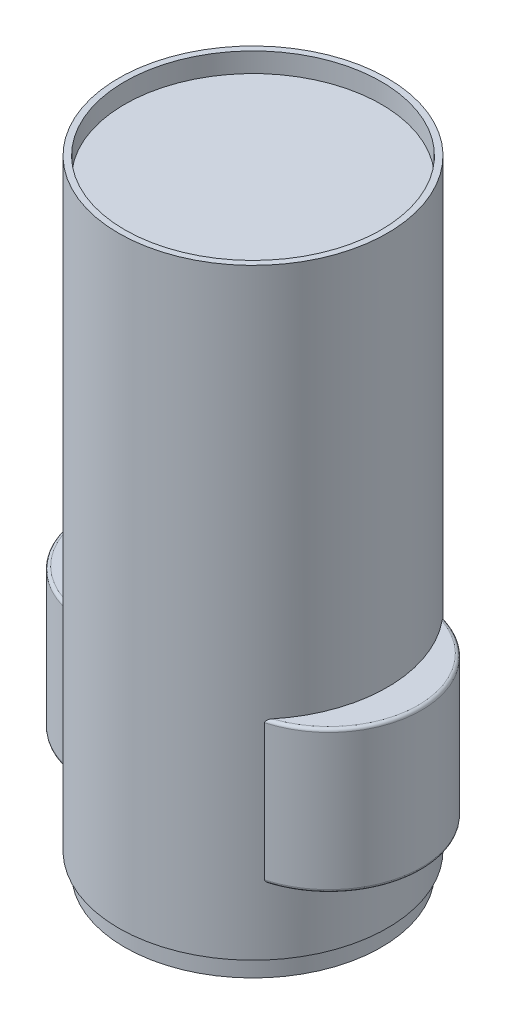
ISO-10303-21;
HEADER;
FILE_DESCRIPTION(('STEP AP214'),'2;1');
FILE_NAME('part.step','',(''),(''),'','','');
FILE_SCHEMA(('AUTOMOTIVE_DESIGN { 1 0 10303 214 1 1 1 1 }'));
ENDSEC;
DATA;
#1=APPLICATION_CONTEXT('core data for automotive mechanical design processes');
#2=APPLICATION_PROTOCOL_DEFINITION('international standard','automotive_design',2000,#1);
#3=PRODUCT_CONTEXT('',#1,'mechanical');
#4=PRODUCT('Part','Part','',(#3));
#5=PRODUCT_RELATED_PRODUCT_CATEGORY('part','',(#4));
#6=PRODUCT_DEFINITION_FORMATION('','',#4);
#7=PRODUCT_DEFINITION_CONTEXT('part definition',#1,'design');
#8=PRODUCT_DEFINITION('design','',#6,#7);
#9=PRODUCT_DEFINITION_SHAPE('','',#8);
#10=(LENGTH_UNIT() NAMED_UNIT(*) SI_UNIT(.MILLI.,.METRE.));
#11=(NAMED_UNIT(*) PLANE_ANGLE_UNIT() SI_UNIT($,.RADIAN.));
#12=(NAMED_UNIT(*) SI_UNIT($,.STERADIAN.) SOLID_ANGLE_UNIT());
#13=UNCERTAINTY_MEASURE_WITH_UNIT(LENGTH_MEASURE(1.E-05),#10,'distance_accuracy_value','');
#14=(GEOMETRIC_REPRESENTATION_CONTEXT(3) GLOBAL_UNCERTAINTY_ASSIGNED_CONTEXT((#13)) GLOBAL_UNIT_ASSIGNED_CONTEXT((#10,
#11,#12)) REPRESENTATION_CONTEXT('',''));
#15=CARTESIAN_POINT('',(0.,0.,0.));
#16=DIRECTION('',(0.,0.,1.));
#17=DIRECTION('',(1.,0.,0.));
#18=AXIS2_PLACEMENT_3D('',#15,#16,#17);
#19=CARTESIAN_POINT('',(0.,199.3,0.));
#20=DIRECTION('',(0.,1.,0.));
#21=DIRECTION('',(0.,0.,1.));
#22=AXIS2_PLACEMENT_3D('',#19,#20,#21);
#23=CYLINDRICAL_SURFACE('',#22,44.5);
#24=CARTESIAN_POINT('',(0.,205.8,0.));
#25=DIRECTION('',(0.,1.,0.));
#26=DIRECTION('',(0.,0.,1.));
#27=AXIS2_PLACEMENT_3D('',#24,#25,#26);
#28=CIRCLE('',#27,44.5);
#29=CARTESIAN_POINT('',(0.,205.8,44.5));
#30=VERTEX_POINT('',#29);
#31=EDGE_CURVE('E188',#30,#30,#28,.T.);
#32=ORIENTED_EDGE('',*,*,#31,.F.);
#33=EDGE_LOOP('',(#32));
#34=FACE_BOUND('',#33,.T.);
#35=CARTESIAN_POINT('',(0.,6.49999999999998,0.));
#36=DIRECTION('',(0.,1.,0.));
#37=DIRECTION('',(0.,0.,1.));
#38=AXIS2_PLACEMENT_3D('',#35,#36,#37);
#39=CIRCLE('',#38,44.5);
#40=CARTESIAN_POINT('',(0.,6.49999999999997,44.5));
#41=VERTEX_POINT('',#40);
#42=EDGE_CURVE('E191',#41,#41,#39,.T.);
#43=ORIENTED_EDGE('',*,*,#42,.T.);
#44=EDGE_LOOP('',(#43));
#45=FACE_BOUND('',#44,.T.);
#46=DIRECTION('',(0.,-1.,0.));
#47=VECTOR('',#46,1.);
#48=CARTESIAN_POINT('',(33.3282803180915,52.035,29.4868738770104));
#49=LINE('',#48,#47);
#50=CARTESIAN_POINT('',(33.3282803180915,74.57,29.4868738770104));
#51=VERTEX_POINT('',#50);
#52=CARTESIAN_POINT('',(33.3282803180915,29.5,29.4868738770104));
#53=VERTEX_POINT('',#52);
#54=EDGE_CURVE('E206',#51,#53,#49,.T.);
#55=ORIENTED_EDGE('',*,*,#54,.F.);
#56=CARTESIAN_POINT('',(33.3282803180915,74.57,29.4868738770104));
#57=CARTESIAN_POINT('',(33.3282290648274,74.6026941237317,29.4869303399323));
#58=CARTESIAN_POINT('',(33.3302284768937,74.6352940124547,29.4846719704872));
#59=CARTESIAN_POINT('',(33.3378637860314,74.6991919996134,29.4760393006147));
#60=CARTESIAN_POINT('',(33.3434638686415,74.7304997219744,29.4697055360972));
#61=CARTESIAN_POINT('',(33.3594192153649,74.7980036695551,29.4516436502028));
#62=CARTESIAN_POINT('',(33.370544747942,74.8337785634002,29.4390408183785));
#63=CARTESIAN_POINT('',(33.396485341139,74.9022007333026,29.409609914728));
#64=CARTESIAN_POINT('',(33.4113149859387,74.9348349226258,29.392765138918));
#65=CARTESIAN_POINT('',(33.4516346665935,75.0119389908455,29.346881596507));
#66=CARTESIAN_POINT('',(33.4787878172227,75.0543735176097,29.3159120704458));
#67=CARTESIAN_POINT('',(33.5368766703659,75.1324837514766,29.2494421360369));
#68=CARTESIAN_POINT('',(33.5678191018013,75.1681471396393,29.2139336624827));
#69=CARTESIAN_POINT('',(33.6276500485631,75.2290649353552,29.1450328354835));
#70=CARTESIAN_POINT('',(33.6562287820361,75.2550769395084,29.1120293654524));
#71=CARTESIAN_POINT('',(33.7146426992063,75.3032701830073,29.0443604457293));
#72=CARTESIAN_POINT('',(33.7444787823177,75.3254486202009,29.0096938037871));
#73=CARTESIAN_POINT('',(33.8355193205995,75.3870399433358,28.9035689894966));
#74=CARTESIAN_POINT('',(33.8980431408311,75.4213051613941,28.8302307541396));
#75=CARTESIAN_POINT('',(34.0079639573205,75.4709328743049,28.7004118095175));
#76=CARTESIAN_POINT('',(34.0550148833266,75.4888966803664,28.6445699545817));
#77=CARTESIAN_POINT('',(34.1496142551314,75.5192581407077,28.5317237699701));
#78=CARTESIAN_POINT('',(34.1971630299818,75.531651840051,28.4747186442662));
#79=CARTESIAN_POINT('',(34.2915505944723,75.5510828137592,28.360975315293));
#80=CARTESIAN_POINT('',(34.3383870002181,75.5582112864938,28.3042503438402));
#81=CARTESIAN_POINT('',(34.431898756543,75.5676543482635,28.1904201735461));
#82=CARTESIAN_POINT('',(34.478574245033,75.5699766769948,28.1333157348268));
#83=CARTESIAN_POINT('',(34.5250994035786,75.57,28.0761021363903));
#84=B_SPLINE_CURVE_WITH_KNOTS('',3,(#56,#57,#58,#59,#60,#61,#62,#63,#64,#65,#66,#67,#68,#69,#70,
#71,#72,#73,#74,#75,#76,#77,#78,#79,#80,#81,#82,#83),.UNSPECIFIED.,.F.,.F.,(4,2,2,2,2,2,2,2,2,2,
2,2,2,4),(0.,0.0977907833194195,0.194623619100568,0.312556690935294,0.430961628564803,
0.607381289542884,0.784118903501161,0.936359281983716,1.08871047450898,1.39455002030677,
1.61995867637769,1.84552712723387,2.06709051691682,2.28829682783787),.UNSPECIFIED.);
#85=CARTESIAN_POINT('',(34.5250994035785,75.57,28.0761021363903));
#86=VERTEX_POINT('',#85);
#87=EDGE_CURVE('E269',#51,#86,#84,.T.);
#88=ORIENTED_EDGE('',*,*,#87,.T.);
#89=CARTESIAN_POINT('',(0.,75.57,0.));
#90=DIRECTION('',(0.,-1.,0.));
#91=DIRECTION('',(0.,0.,-1.));
#92=AXIS2_PLACEMENT_3D('',#89,#90,#91);
#93=CIRCLE('',#92,44.5);
#94=CARTESIAN_POINT('',(34.5250994035785,75.57,-28.0761021363903));
#95=VERTEX_POINT('',#94);
#96=EDGE_CURVE('E205',#86,#95,#93,.F.);
#97=ORIENTED_EDGE('',*,*,#96,.T.);
#98=CARTESIAN_POINT('',(34.5250994035785,75.57,-28.0761021363903));
#99=CARTESIAN_POINT('',(34.471886137988,75.5699594992287,-28.1415416811893));
#100=CARTESIAN_POINT('',(34.4184661535623,75.566930112156,-28.2068487604138));
#101=CARTESIAN_POINT('',(34.3113889509015,75.5545478072244,-28.3370016309063));
#102=CARTESIAN_POINT('',(34.2577315120177,75.5451752217279,-28.4018453516787));
#103=CARTESIAN_POINT('',(34.1504178926029,75.519691929258,-28.5307911176014));
#104=CARTESIAN_POINT('',(34.0967631197051,75.5035470340788,-28.594887679342));
#105=CARTESIAN_POINT('',(33.9902994158401,75.4638607460808,-28.7213570976742));
#106=CARTESIAN_POINT('',(33.9374893288381,75.4403305713274,-28.7837324134913));
#107=CARTESIAN_POINT('',(33.8466803975093,75.3918891807662,-28.8904103855184));
#108=CARTESIAN_POINT('',(33.8083356271671,75.3688568274594,-28.9352690547207));
#109=CARTESIAN_POINT('',(33.7329920912511,75.3174471095592,-29.0230698624084));
#110=CARTESIAN_POINT('',(33.6959933682544,75.2890695760661,-29.0660119402794));
#111=CARTESIAN_POINT('',(33.6238337207307,75.2258820795504,-29.1494574891499));
#112=CARTESIAN_POINT('',(33.5886899967836,75.1910221530623,-29.1899385354299));
#113=CARTESIAN_POINT('',(33.5219136178637,75.1139527204496,-29.266599871983));
#114=CARTESIAN_POINT('',(33.4902726723159,75.0717612035702,-29.3027903325259));
#115=CARTESIAN_POINT('',(33.4442255225117,74.9974912433359,-29.3553143046088));
#116=CARTESIAN_POINT('',(33.427979634385,74.9680937562659,-29.3738095103277));
#117=CARTESIAN_POINT('',(33.3982889739881,74.9061176044222,-29.4075635929464));
#118=CARTESIAN_POINT('',(33.384844802923,74.8735382590694,-29.4228217752439));
#119=CARTESIAN_POINT('',(33.3615321712417,74.8049792472937,-29.4492527673272));
#120=CARTESIAN_POINT('',(33.3517118060886,74.7689613136333,-29.4603706432227));
#121=CARTESIAN_POINT('',(33.3369283456302,74.6947536654882,-29.4770985480268));
#122=CARTESIAN_POINT('',(33.3319471321069,74.6565726228997,-29.4827291221386));
#123=CARTESIAN_POINT('',(33.3292193392278,74.6101066554781,-29.4858124833861));
#124=CARTESIAN_POINT('',(33.3288674390376,74.6020923627154,-29.4862102513128));
#125=CARTESIAN_POINT('',(33.3283983710121,74.586053172617,-29.4867404526471));
#126=CARTESIAN_POINT('',(33.3282810559128,74.5780282851008,-29.4868730525174));
#127=CARTESIAN_POINT('',(33.3282803180915,74.57,-29.4868738770104));
#128=B_SPLINE_CURVE_WITH_KNOTS('',3,(#98,#99,#100,#101,#102,#103,#104,#105,#106,#107,#108,#109,
#110,#111,#112,#113,#114,#115,#116,#117,#118,#119,#120,#121,#122,#123,#124,#125,#126,#127),
.UNSPECIFIED.,.F.,.F.,(4,2,2,2,2,2,2,2,2,2,2,2,2,2,4),(0.,0.253023706346703,0.50683555079611,
0.761944417442202,1.0166676399544,1.20650028717804,1.39633893383444,1.5877064596561,
1.77861089874805,1.89335142921242,2.00811655592235,2.12435429681833,2.24015513641538,
2.26424639201346,2.28832251924724),.UNSPECIFIED.);
#129=CARTESIAN_POINT('',(33.3282803180915,74.57,-29.4868738770104));
#130=VERTEX_POINT('',#129);
#131=EDGE_CURVE('E276',#95,#130,#128,.T.);
#132=ORIENTED_EDGE('',*,*,#131,.T.);
#133=DIRECTION('',(0.,-1.,0.));
#134=VECTOR('',#133,1.);
#135=CARTESIAN_POINT('',(33.3282803180915,52.035,-29.4868738770104));
#136=LINE('',#135,#134);
#137=CARTESIAN_POINT('',(33.3282803180915,29.5,-29.4868738770104));
#138=VERTEX_POINT('',#137);
#139=EDGE_CURVE('E209',#138,#130,#136,.F.);
#140=ORIENTED_EDGE('',*,*,#139,.F.);
#141=CARTESIAN_POINT('',(33.3282803180915,29.5,-29.4868738770104));
#142=CARTESIAN_POINT('',(33.3282290648274,29.4673058762683,-29.4869303399324));
#143=CARTESIAN_POINT('',(33.3302284768936,29.4347059875453,-29.4846719704872));
#144=CARTESIAN_POINT('',(33.3378637860314,29.3708080003866,-29.4760393006147));
#145=CARTESIAN_POINT('',(33.3434638686415,29.3395002780256,-29.4697055360972));
#146=CARTESIAN_POINT('',(33.3594192153649,29.2719963304449,-29.4516436502028));
#147=CARTESIAN_POINT('',(33.370544747942,29.2362214365998,-29.4390408183785));
#148=CARTESIAN_POINT('',(33.396485341139,29.1677992666973,-29.409609914728));
#149=CARTESIAN_POINT('',(33.4113149859387,29.1351650773742,-29.3927651389181));
#150=CARTESIAN_POINT('',(33.4516346665935,29.0580610091545,-29.3468815965071));
#151=CARTESIAN_POINT('',(33.4787878172227,29.0156264823903,-29.3159120704458));
#152=CARTESIAN_POINT('',(33.5368766703659,28.9375162485234,-29.2494421360369));
#153=CARTESIAN_POINT('',(33.5678191018013,28.9018528603607,-29.2139336624827));
#154=CARTESIAN_POINT('',(33.6276500485631,28.8409350646448,-29.1450328354835));
#155=CARTESIAN_POINT('',(33.6562287820361,28.8149230604916,-29.1120293654524));
#156=CARTESIAN_POINT('',(33.7146426992063,28.7667298169927,-29.0443604457293));
#157=CARTESIAN_POINT('',(33.7444787823177,28.7445513797991,-29.0096938037871));
#158=CARTESIAN_POINT('',(33.8355193205995,28.6829600566642,-28.9035689894966));
#159=CARTESIAN_POINT('',(33.898043140831,28.6486948386059,-28.8302307541397));
#160=CARTESIAN_POINT('',(34.0079639573205,28.5990671256951,-28.7004118095175));
#161=CARTESIAN_POINT('',(34.0550148833266,28.5811033196336,-28.6445699545817));
#162=CARTESIAN_POINT('',(34.1496142551314,28.5507418592922,-28.5317237699702));
#163=CARTESIAN_POINT('',(34.1971630299818,28.538348159949,-28.4747186442662));
#164=CARTESIAN_POINT('',(34.2915505944723,28.5189171862408,-28.360975315293));
#165=CARTESIAN_POINT('',(34.338387000218,28.5117887135062,-28.3042503438402));
#166=CARTESIAN_POINT('',(34.431898756543,28.5023456517365,-28.1904201735462));
#167=CARTESIAN_POINT('',(34.478574245033,28.5000233230052,-28.1333157348268));
#168=CARTESIAN_POINT('',(34.5250994035785,28.5,-28.0761021363903));
#169=B_SPLINE_CURVE_WITH_KNOTS('',3,(#141,#142,#143,#144,#145,#146,#147,#148,#149,#150,#151,
#152,#153,#154,#155,#156,#157,#158,#159,#160,#161,#162,#163,#164,#165,#166,#167,#168),
.UNSPECIFIED.,.F.,.F.,(4,2,2,2,2,2,2,2,2,2,2,2,2,4),(0.,0.0977907833194221,0.194623619100572,
0.312556690935311,0.430961628564806,0.607381289542887,0.784118903501163,0.936359281983706,
1.08871047450897,1.39455002030677,1.61995867637769,1.84552712723387,2.06709051691681,
2.28829682783787),.UNSPECIFIED.);
#170=CARTESIAN_POINT('',(34.5250994035785,28.5,-28.0761021363903));
#171=VERTEX_POINT('',#170);
#172=EDGE_CURVE('E246',#138,#171,#169,.T.);
#173=ORIENTED_EDGE('',*,*,#172,.T.);
#174=CARTESIAN_POINT('',(0.,28.5,0.));
#175=DIRECTION('',(0.,-1.,0.));
#176=DIRECTION('',(0.,0.,-1.));
#177=AXIS2_PLACEMENT_3D('',#174,#175,#176);
#178=CIRCLE('',#177,44.5);
#179=CARTESIAN_POINT('',(34.5250994035786,28.5,28.0761021363903));
#180=VERTEX_POINT('',#179);
#181=EDGE_CURVE('E200',#180,#171,#178,.F.);
#182=ORIENTED_EDGE('',*,*,#181,.F.);
#183=CARTESIAN_POINT('',(34.5250994035785,28.5,28.0761021363903));
#184=CARTESIAN_POINT('',(34.4718861379881,28.5000405007713,28.1415416811893));
#185=CARTESIAN_POINT('',(34.4184661535623,28.503069887844,28.2068487604138));
#186=CARTESIAN_POINT('',(34.3113889509015,28.5154521927756,28.3370016309063));
#187=CARTESIAN_POINT('',(34.2577315120177,28.5248247782721,28.4018453516786));
#188=CARTESIAN_POINT('',(34.1504178926029,28.550308070742,28.5307911176014));
#189=CARTESIAN_POINT('',(34.0967631197051,28.5664529659212,28.594887679342));
#190=CARTESIAN_POINT('',(33.9902994158401,28.6061392539192,28.7213570976741));
#191=CARTESIAN_POINT('',(33.9374893288382,28.6296694286726,28.7837324134913));
#192=CARTESIAN_POINT('',(33.8466803975093,28.6781108192338,28.8904103855184));
#193=CARTESIAN_POINT('',(33.8083356271672,28.7011431725406,28.9352690547207));
#194=CARTESIAN_POINT('',(33.7329920912511,28.7525528904408,29.0230698624084));
#195=CARTESIAN_POINT('',(33.6959933682544,28.7809304239339,29.0660119402794));
#196=CARTESIAN_POINT('',(33.6238337207308,28.8441179204496,29.1494574891499));
#197=CARTESIAN_POINT('',(33.5886899967836,28.8789778469376,29.1899385354299));
#198=CARTESIAN_POINT('',(33.5219136178638,28.9560472795504,29.266599871983));
#199=CARTESIAN_POINT('',(33.4902726723159,28.9982387964297,29.3027903325258));
#200=CARTESIAN_POINT('',(33.4442255225117,29.0725087566641,29.3553143046088));
#201=CARTESIAN_POINT('',(33.427979634385,29.1019062437341,29.3738095103276));
#202=CARTESIAN_POINT('',(33.3982889739881,29.1638823955777,29.4075635929464));
#203=CARTESIAN_POINT('',(33.384844802923,29.1964617409306,29.4228217752438));
#204=CARTESIAN_POINT('',(33.3615321712417,29.2650207527063,29.4492527673272));
#205=CARTESIAN_POINT('',(33.3517118060886,29.3010386863667,29.4603706432227));
#206=CARTESIAN_POINT('',(33.3369283456302,29.3752463345118,29.4770985480268));
#207=CARTESIAN_POINT('',(33.3319471321069,29.4134273771003,29.4827291221386));
#208=CARTESIAN_POINT('',(33.3292193392278,29.4598933445218,29.4858124833861));
#209=CARTESIAN_POINT('',(33.3288674390376,29.4679076372845,29.4862102513128));
#210=CARTESIAN_POINT('',(33.3283983710121,29.483946827383,29.4867404526471));
#211=CARTESIAN_POINT('',(33.3282810559129,29.4919717148992,29.4868730525174));
#212=CARTESIAN_POINT('',(33.3282803180915,29.5,29.4868738770104));
#213=B_SPLINE_CURVE_WITH_KNOTS('',3,(#183,#184,#185,#186,#187,#188,#189,#190,#191,#192,#193,
#194,#195,#196,#197,#198,#199,#200,#201,#202,#203,#204,#205,#206,#207,#208,#209,#210,#211,#212),
.UNSPECIFIED.,.F.,.F.,(4,2,2,2,2,2,2,2,2,2,2,2,2,2,4),(0.,0.253023706346701,0.50683555079612,
0.761944417442207,1.0166676399544,1.20650028717802,1.39633893383443,1.58770645965609,
1.77861089874804,1.8933514292124,2.00811655592233,2.1243542968183,2.24015513641535,
2.26424639201344,2.28832251924726),.UNSPECIFIED.);
#214=EDGE_CURVE('E239',#180,#53,#213,.T.);
#215=ORIENTED_EDGE('',*,*,#214,.T.);
#216=EDGE_LOOP('',(#55,#88,#97,#132,#140,#173,#182,#215));
#217=FACE_BOUND('',#216,.T.);
#218=CARTESIAN_POINT('',(0.,175.57,0.));
#219=DIRECTION('',(0.,-1.,0.));
#220=DIRECTION('',(0.,0.,1.));
#221=AXIS2_PLACEMENT_3D('',#218,#219,#220);
#222=CIRCLE('',#221,44.5);
#223=CARTESIAN_POINT('',(-44.2097122743787,175.57,5.07457787571034));
#224=VERTEX_POINT('',#223);
#225=CARTESIAN_POINT('',(-44.2097122743787,175.57,-5.07457787571028));
#226=VERTEX_POINT('',#225);
#227=EDGE_CURVE('E415',#224,#226,#222,.T.);
#228=ORIENTED_EDGE('',*,*,#227,.F.);
#229=DIRECTION('',(0.,-1.,0.));
#230=VECTOR('',#229,1.);
#231=CARTESIAN_POINT('',(-44.2097122743787,175.57,5.07457787571032));
#232=LINE('',#231,#230);
#233=CARTESIAN_POINT('',(-44.2097122743787,75.57,5.0745778757103));
#234=VERTEX_POINT('',#233);
#235=EDGE_CURVE('E178',#224,#234,#232,.T.);
#236=ORIENTED_EDGE('',*,*,#235,.T.);
#237=CARTESIAN_POINT('',(-34.5250994035785,75.57,28.0761021363903));
#238=VERTEX_POINT('',#237);
#239=EDGE_CURVE('E215',#234,#238,#93,.F.);
#240=ORIENTED_EDGE('',*,*,#239,.T.);
#241=CARTESIAN_POINT('',(-34.5250994035785,75.57,28.0761021363903));
#242=CARTESIAN_POINT('',(-34.4718861379881,75.5699594992286,28.1415416811893));
#243=CARTESIAN_POINT('',(-34.4184661535623,75.566930112156,28.2068487604138));
#244=CARTESIAN_POINT('',(-34.3113889509015,75.5545478072243,28.3370016309063));
#245=CARTESIAN_POINT('',(-34.2577315120177,75.5451752217279,28.4018453516786));
#246=CARTESIAN_POINT('',(-34.1504178926029,75.519691929258,28.5307911176014));
#247=CARTESIAN_POINT('',(-34.0967631197051,75.5035470340788,28.594887679342));
#248=CARTESIAN_POINT('',(-33.9902994158401,75.4638607460808,28.7213570976742));
#249=CARTESIAN_POINT('',(-33.9374893288381,75.4403305713274,28.7837324134913));
#250=CARTESIAN_POINT('',(-33.8466803975093,75.3918891807662,28.8904103855184));
#251=CARTESIAN_POINT('',(-33.8083356271672,75.3688568274594,28.9352690547207));
#252=CARTESIAN_POINT('',(-33.7329920912511,75.3174471095592,29.0230698624084));
#253=CARTESIAN_POINT('',(-33.6959933682544,75.2890695760661,29.0660119402794));
#254=CARTESIAN_POINT('',(-33.6238337207308,75.2258820795504,29.1494574891499));
#255=CARTESIAN_POINT('',(-33.5886899967836,75.1910221530623,29.1899385354299));
#256=CARTESIAN_POINT('',(-33.5219136178638,75.1139527204496,29.266599871983));
#257=CARTESIAN_POINT('',(-33.4902726723159,75.0717612035703,29.3027903325258));
#258=CARTESIAN_POINT('',(-33.4442255225117,74.9974912433359,29.3553143046088));
#259=CARTESIAN_POINT('',(-33.427979634385,74.9680937562659,29.3738095103276));
#260=CARTESIAN_POINT('',(-33.3982889739881,74.9061176044223,29.4075635929464));
#261=CARTESIAN_POINT('',(-33.384844802923,74.8735382590694,29.4228217752438));
#262=CARTESIAN_POINT('',(-33.3615321712417,74.8049792472937,29.4492527673272));
#263=CARTESIAN_POINT('',(-33.3517118060886,74.7689613136333,29.4603706432227));
#264=CARTESIAN_POINT('',(-33.3369283456302,74.6947536654882,29.4770985480268));
#265=CARTESIAN_POINT('',(-33.3319471321069,74.6565726228997,29.4827291221386));
#266=CARTESIAN_POINT('',(-33.3292193392278,74.6101066554781,29.4858124833861));
#267=CARTESIAN_POINT('',(-33.3288674390376,74.6020923627155,29.4862102513128));
#268=CARTESIAN_POINT('',(-33.3283983710121,74.586053172617,29.4867404526471));
#269=CARTESIAN_POINT('',(-33.3282810559129,74.5780282851008,29.4868730525174));
#270=CARTESIAN_POINT('',(-33.3282803180915,74.57,29.4868738770104));
#271=B_SPLINE_CURVE_WITH_KNOTS('',3,(#241,#242,#243,#244,#245,#246,#247,#248,#249,#250,#251,
#252,#253,#254,#255,#256,#257,#258,#259,#260,#261,#262,#263,#264,#265,#266,#267,#268,#269,#270),
.UNSPECIFIED.,.F.,.F.,(4,2,2,2,2,2,2,2,2,2,2,2,2,2,4),(0.,0.253023706346694,0.506835550796111,
0.761944417442205,1.0166676399544,1.20650028717803,1.39633893383442,1.58770645965607,
1.77861089874802,1.89335142921238,2.0081165559223,2.1243542968183,2.24015513641536,
2.26424639201345,2.28832251924727),.UNSPECIFIED.);
#272=CARTESIAN_POINT('',(-33.3282803180915,74.57,29.4868738770104));
#273=VERTEX_POINT('',#272);
#274=EDGE_CURVE('E11',#238,#273,#271,.T.);
#275=ORIENTED_EDGE('',*,*,#274,.T.);
#276=DIRECTION('',(0.,-1.,0.));
#277=VECTOR('',#276,1.);
#278=CARTESIAN_POINT('',(-33.3282803180915,52.035,29.4868738770104));
#279=LINE('',#278,#277);
#280=CARTESIAN_POINT('',(-33.3282803180915,29.5,29.4868738770104));
#281=VERTEX_POINT('',#280);
#282=EDGE_CURVE('E218',#281,#273,#279,.F.);
#283=ORIENTED_EDGE('',*,*,#282,.F.);
#284=CARTESIAN_POINT('',(-33.3282803180915,29.5,29.4868738770104));
#285=CARTESIAN_POINT('',(-33.3282290648274,29.4673058762683,29.4869303399323));
#286=CARTESIAN_POINT('',(-33.3302284768937,29.4347059875453,29.4846719704872));
#287=CARTESIAN_POINT('',(-33.3378637860314,29.3708080003866,29.4760393006147));
#288=CARTESIAN_POINT('',(-33.3434638686415,29.3395002780256,29.4697055360972));
#289=CARTESIAN_POINT('',(-33.3594192153649,29.2719963304449,29.4516436502028));
#290=CARTESIAN_POINT('',(-33.370544747942,29.2362214365998,29.4390408183785));
#291=CARTESIAN_POINT('',(-33.396485341139,29.1677992666973,29.409609914728));
#292=CARTESIAN_POINT('',(-33.4113149859387,29.1351650773742,29.392765138918));
#293=CARTESIAN_POINT('',(-33.4516346665935,29.0580610091545,29.346881596507));
#294=CARTESIAN_POINT('',(-33.4787878172227,29.0156264823903,29.3159120704458));
#295=CARTESIAN_POINT('',(-33.5368766703659,28.9375162485234,29.2494421360369));
#296=CARTESIAN_POINT('',(-33.5678191018013,28.9018528603607,29.2139336624827));
#297=CARTESIAN_POINT('',(-33.6276500485631,28.8409350646448,29.1450328354835));
#298=CARTESIAN_POINT('',(-33.6562287820361,28.8149230604916,29.1120293654524));
#299=CARTESIAN_POINT('',(-33.7146426992063,28.7667298169927,29.0443604457293));
#300=CARTESIAN_POINT('',(-33.7444787823177,28.7445513797991,29.0096938037871));
#301=CARTESIAN_POINT('',(-33.8355193205995,28.6829600566642,28.9035689894966));
#302=CARTESIAN_POINT('',(-33.898043140831,28.6486948386059,28.8302307541397));
#303=CARTESIAN_POINT('',(-34.0079639573205,28.5990671256951,28.7004118095175));
#304=CARTESIAN_POINT('',(-34.0550148833266,28.5811033196336,28.6445699545817));
#305=CARTESIAN_POINT('',(-34.1496142551314,28.5507418592922,28.5317237699701));
#306=CARTESIAN_POINT('',(-34.1971630299818,28.538348159949,28.4747186442662));
#307=CARTESIAN_POINT('',(-34.2915505944723,28.5189171862408,28.360975315293));
#308=CARTESIAN_POINT('',(-34.3383870002181,28.5117887135062,28.3042503438402));
#309=CARTESIAN_POINT('',(-34.431898756543,28.5023456517365,28.1904201735461));
#310=CARTESIAN_POINT('',(-34.478574245033,28.5000233230052,28.1333157348268));
#311=CARTESIAN_POINT('',(-34.5250994035785,28.5,28.0761021363903));
#312=B_SPLINE_CURVE_WITH_KNOTS('',3,(#284,#285,#286,#287,#288,#289,#290,#291,#292,#293,#294,
#295,#296,#297,#298,#299,#300,#301,#302,#303,#304,#305,#306,#307,#308,#309,#310,#311),
.UNSPECIFIED.,.F.,.F.,(4,2,2,2,2,2,2,2,2,2,2,2,2,4),(0.,0.0977907833194227,0.194623619100574,
0.312556690935314,0.430961628564804,0.607381289542881,0.784118903501155,0.9363592819837,
1.08871047450897,1.39455002030675,1.61995867637767,1.84552712723386,2.06709051691681,
2.28829682783787),.UNSPECIFIED.);
#313=CARTESIAN_POINT('',(-34.5250994035786,28.5,28.0761021363903));
#314=VERTEX_POINT('',#313);
#315=EDGE_CURVE('E290',#281,#314,#312,.T.);
#316=ORIENTED_EDGE('',*,*,#315,.T.);
#317=CARTESIAN_POINT('',(-34.5250994035785,28.5,-28.0761021363903));
#318=VERTEX_POINT('',#317);
#319=EDGE_CURVE('E201',#318,#314,#178,.F.);
#320=ORIENTED_EDGE('',*,*,#319,.F.);
#321=CARTESIAN_POINT('',(-34.5250994035785,28.5,-28.0761021363903));
#322=CARTESIAN_POINT('',(-34.471886137988,28.5000405007713,-28.1415416811893));
#323=CARTESIAN_POINT('',(-34.4184661535623,28.503069887844,-28.2068487604138));
#324=CARTESIAN_POINT('',(-34.3113889509015,28.5154521927757,-28.3370016309063));
#325=CARTESIAN_POINT('',(-34.2577315120177,28.5248247782721,-28.4018453516787));
#326=CARTESIAN_POINT('',(-34.1504178926029,28.550308070742,-28.5307911176014));
#327=CARTESIAN_POINT('',(-34.0967631197051,28.5664529659212,-28.594887679342));
#328=CARTESIAN_POINT('',(-33.9902994158401,28.6061392539192,-28.7213570976742));
#329=CARTESIAN_POINT('',(-33.9374893288381,28.6296694286726,-28.7837324134913));
#330=CARTESIAN_POINT('',(-33.8466803975093,28.6781108192338,-28.8904103855184));
#331=CARTESIAN_POINT('',(-33.8083356271671,28.7011431725406,-28.9352690547207));
#332=CARTESIAN_POINT('',(-33.7329920912511,28.7525528904408,-29.0230698624084));
#333=CARTESIAN_POINT('',(-33.6959933682544,28.7809304239339,-29.0660119402794));
#334=CARTESIAN_POINT('',(-33.6238337207307,28.8441179204496,-29.1494574891499));
#335=CARTESIAN_POINT('',(-33.5886899967836,28.8789778469377,-29.1899385354299));
#336=CARTESIAN_POINT('',(-33.5219136178637,28.9560472795504,-29.266599871983));
#337=CARTESIAN_POINT('',(-33.4902726723159,28.9982387964297,-29.3027903325259));
#338=CARTESIAN_POINT('',(-33.4442255225117,29.0725087566641,-29.3553143046088));
#339=CARTESIAN_POINT('',(-33.427979634385,29.1019062437342,-29.3738095103277));
#340=CARTESIAN_POINT('',(-33.3982889739881,29.1638823955778,-29.4075635929464));
#341=CARTESIAN_POINT('',(-33.384844802923,29.1964617409306,-29.4228217752439));
#342=CARTESIAN_POINT('',(-33.3615321712417,29.2650207527063,-29.4492527673272));
#343=CARTESIAN_POINT('',(-33.3517118060886,29.3010386863667,-29.4603706432227));
#344=CARTESIAN_POINT('',(-33.3369283456302,29.3752463345118,-29.4770985480269));
#345=CARTESIAN_POINT('',(-33.3319471321069,29.4134273771003,-29.4827291221386));
#346=CARTESIAN_POINT('',(-33.3292193392278,29.4598933445219,-29.4858124833861));
#347=CARTESIAN_POINT('',(-33.3288674390376,29.4679076372846,-29.4862102513128));
#348=CARTESIAN_POINT('',(-33.3283983710121,29.483946827383,-29.4867404526471));
#349=CARTESIAN_POINT('',(-33.3282810559128,29.4919717148992,-29.4868730525174));
#350=CARTESIAN_POINT('',(-33.3282803180915,29.5,-29.4868738770104));
#351=B_SPLINE_CURVE_WITH_KNOTS('',3,(#321,#322,#323,#324,#325,#326,#327,#328,#329,#330,#331,
#332,#333,#334,#335,#336,#337,#338,#339,#340,#341,#342,#343,#344,#345,#346,#347,#348,#349,#350),
.UNSPECIFIED.,.F.,.F.,(4,2,2,2,2,2,2,2,2,2,2,2,2,2,4),(0.,0.253023706346706,0.50683555079611,
0.761944417442204,1.0166676399544,1.20650028717803,1.39633893383444,1.5877064596561,
1.77861089874805,1.89335142921242,2.00811655592234,2.12435429681832,2.24015513641538,
2.26424639201346,2.28832251924726),.UNSPECIFIED.);
#352=CARTESIAN_POINT('',(-33.3282803180915,29.5,-29.4868738770104));
#353=VERTEX_POINT('',#352);
#354=EDGE_CURVE('E283',#318,#353,#351,.T.);
#355=ORIENTED_EDGE('',*,*,#354,.T.);
#356=DIRECTION('',(0.,-1.,0.));
#357=VECTOR('',#356,1.);
#358=CARTESIAN_POINT('',(-33.3282803180915,52.035,-29.4868738770104));
#359=LINE('',#358,#357);
#360=CARTESIAN_POINT('',(-33.3282803180915,74.57,-29.4868738770104));
#361=VERTEX_POINT('',#360);
#362=EDGE_CURVE('E204',#361,#353,#359,.T.);
#363=ORIENTED_EDGE('',*,*,#362,.F.);
#364=CARTESIAN_POINT('',(-33.3282803180915,74.57,-29.4868738770104));
#365=CARTESIAN_POINT('',(-33.3282290648274,74.6026941237317,-29.4869303399323));
#366=CARTESIAN_POINT('',(-33.3302284768936,74.6352940124547,-29.4846719704872));
#367=CARTESIAN_POINT('',(-33.3378637860314,74.6991919996134,-29.4760393006147));
#368=CARTESIAN_POINT('',(-33.3434638686415,74.7304997219744,-29.4697055360972));
#369=CARTESIAN_POINT('',(-33.3594192153649,74.7980036695551,-29.4516436502028));
#370=CARTESIAN_POINT('',(-33.370544747942,74.8337785634002,-29.4390408183785));
#371=CARTESIAN_POINT('',(-33.396485341139,74.9022007333026,-29.409609914728));
#372=CARTESIAN_POINT('',(-33.4113149859387,74.9348349226258,-29.3927651389181));
#373=CARTESIAN_POINT('',(-33.4516346665934,75.0119389908455,-29.3468815965071));
#374=CARTESIAN_POINT('',(-33.4787878172227,75.0543735176097,-29.3159120704458));
#375=CARTESIAN_POINT('',(-33.5368766703659,75.1324837514765,-29.2494421360369));
#376=CARTESIAN_POINT('',(-33.5678191018012,75.1681471396393,-29.2139336624827));
#377=CARTESIAN_POINT('',(-33.6276500485631,75.2290649353552,-29.1450328354835));
#378=CARTESIAN_POINT('',(-33.6562287820361,75.2550769395084,-29.1120293654524));
#379=CARTESIAN_POINT('',(-33.7146426992063,75.3032701830073,-29.0443604457293));
#380=CARTESIAN_POINT('',(-33.7444787823177,75.3254486202009,-29.0096938037871));
#381=CARTESIAN_POINT('',(-33.8355193205995,75.3870399433358,-28.9035689894966));
#382=CARTESIAN_POINT('',(-33.898043140831,75.4213051613941,-28.8302307541397));
#383=CARTESIAN_POINT('',(-34.0079639573205,75.4709328743049,-28.7004118095175));
#384=CARTESIAN_POINT('',(-34.0550148833266,75.4888966803664,-28.6445699545818));
#385=CARTESIAN_POINT('',(-34.1496142551313,75.5192581407077,-28.5317237699702));
#386=CARTESIAN_POINT('',(-34.1971630299818,75.531651840051,-28.4747186442663));
#387=CARTESIAN_POINT('',(-34.2915505944723,75.5510828137592,-28.360975315293));
#388=CARTESIAN_POINT('',(-34.338387000218,75.5582112864938,-28.3042503438402));
#389=CARTESIAN_POINT('',(-34.431898756543,75.5676543482635,-28.1904201735462));
#390=CARTESIAN_POINT('',(-34.478574245033,75.5699766769948,-28.1333157348268));
#391=CARTESIAN_POINT('',(-34.5250994035785,75.57,-28.0761021363903));
#392=B_SPLINE_CURVE_WITH_KNOTS('',3,(#364,#365,#366,#367,#368,#369,#370,#371,#372,#373,#374,
#375,#376,#377,#378,#379,#380,#381,#382,#383,#384,#385,#386,#387,#388,#389,#390,#391),
.UNSPECIFIED.,.F.,.F.,(4,2,2,2,2,2,2,2,2,2,2,2,2,4),(0.,0.0977907833194186,0.194623619100568,
0.312556690935294,0.430961628564792,0.607381289542852,0.784118903501126,0.936359281983668,
1.08871047450892,1.39455002030671,1.61995867637765,1.84552712723384,2.0670905169168,
2.28829682783787),.UNSPECIFIED.);
#393=CARTESIAN_POINT('',(-34.5250994035785,75.57,-28.0761021363903));
#394=VERTEX_POINT('',#393);
#395=EDGE_CURVE('E49',#361,#394,#392,.T.);
#396=ORIENTED_EDGE('',*,*,#395,.T.);
#397=CARTESIAN_POINT('',(-44.2097122743787,75.57,-5.07457787571029));
#398=VERTEX_POINT('',#397);
#399=EDGE_CURVE('E212',#394,#398,#93,.F.);
#400=ORIENTED_EDGE('',*,*,#399,.T.);
#401=DIRECTION('',(0.,-1.,0.));
#402=VECTOR('',#401,1.);
#403=CARTESIAN_POINT('',(-44.2097122743787,175.57,-5.07457787571028));
#404=LINE('',#403,#402);
#405=EDGE_CURVE('E175',#226,#398,#404,.T.);
#406=ORIENTED_EDGE('',*,*,#405,.F.);
#407=EDGE_LOOP('',(#228,#236,#240,#275,#283,#316,#320,#355,#363,#396,#400,#406));
#408=FACE_BOUND('',#407,.T.);
#409=ADVANCED_FACE('F35',(#34,#45,#217,#408),#23,.T.);
#410=CARTESIAN_POINT('',(0.,75.57,0.));
#411=DIRECTION('',(0.,-1.,0.));
#412=DIRECTION('',(0.,0.,-1.));
#413=AXIS2_PLACEMENT_3D('',#410,#411,#412);
#414=PLANE('',#413);
#415=ORIENTED_EDGE('',*,*,#399,.F.);
#416=CARTESIAN_POINT('',(-25.15,75.57,0.));
#417=DIRECTION('',(0.,-1.,0.));
#418=DIRECTION('',(0.,0.,-1.));
#419=AXIS2_PLACEMENT_3D('',#416,#417,#418);
#420=CIRCLE('',#419,29.6);
#421=EDGE_CURVE('E56',#394,#238,#420,.F.);
#422=ORIENTED_EDGE('',*,*,#421,.T.);
#423=ORIENTED_EDGE('',*,*,#239,.F.);
#424=CARTESIAN_POINT('',(-44.5574291124918,75.57,5.11449028596872));
#425=DIRECTION('',(0.,-1.,0.));
#426=DIRECTION('',(0.,0.,-1.));
#427=AXIS2_PLACEMENT_3D('',#424,#425,#426);
#428=CIRCLE('',#427,0.350000000000008);
#429=CARTESIAN_POINT('',(-44.9068017265158,75.57,5.0935432916723));
#430=VERTEX_POINT('',#429);
#431=EDGE_CURVE('E145',#430,#234,#428,.T.);
#432=ORIENTED_EDGE('',*,*,#431,.F.);
#433=CARTESIAN_POINT('',(-46.467,75.57,5.00000000000001));
#434=DIRECTION('',(0.,1.,0.));
#435=DIRECTION('',(0.,0.,-1.));
#436=AXIS2_PLACEMENT_3D('',#433,#434,#435);
#437=CIRCLE('',#436,1.563);
#438=CARTESIAN_POINT('',(-48.03,75.57,5.00000000000001));
#439=VERTEX_POINT('',#438);
#440=EDGE_CURVE('E139',#439,#430,#437,.T.);
#441=ORIENTED_EDGE('',*,*,#440,.F.);
#442=DIRECTION('',(0.,0.,1.));
#443=VECTOR('',#442,1.);
#444=CARTESIAN_POINT('',(-48.03,75.57,5.00000000000001));
#445=LINE('',#444,#443);
#446=CARTESIAN_POINT('',(-48.03,75.57,-4.99999999999999));
#447=VERTEX_POINT('',#446);
#448=EDGE_CURVE('E142',#447,#439,#445,.T.);
#449=ORIENTED_EDGE('',*,*,#448,.F.);
#450=CARTESIAN_POINT('',(-46.467,75.57,-4.99999999999999));
#451=DIRECTION('',(0.,1.,0.));
#452=DIRECTION('',(0.,0.,-1.));
#453=AXIS2_PLACEMENT_3D('',#450,#451,#452);
#454=CIRCLE('',#453,1.563);
#455=CARTESIAN_POINT('',(-44.9068017265158,75.57,-5.09354329167228));
#456=VERTEX_POINT('',#455);
#457=EDGE_CURVE('E161',#456,#447,#454,.T.);
#458=ORIENTED_EDGE('',*,*,#457,.F.);
#459=CARTESIAN_POINT('',(-44.5574291124918,75.57,-5.11449028596869));
#460=DIRECTION('',(0.,-1.,0.));
#461=DIRECTION('',(0.,0.,1.));
#462=AXIS2_PLACEMENT_3D('',#459,#460,#461);
#463=CIRCLE('',#462,0.350000000000008);
#464=EDGE_CURVE('E405',#398,#456,#463,.T.);
#465=ORIENTED_EDGE('',*,*,#464,.F.);
#466=EDGE_LOOP('',(#415,#422,#423,#432,#441,#449,#458,#465));
#467=FACE_BOUND('',#466,.T.);
#468=ADVANCED_FACE('F141',(#467),#414,.F.);
#469=CARTESIAN_POINT('',(0.,0.,0.));
#470=DIRECTION('',(0.,-1.,0.));
#471=DIRECTION('',(0.,0.,-1.));
#472=AXIS2_PLACEMENT_3D('',#469,#470,#471);
#473=PLANE('',#472);
#474=CARTESIAN_POINT('',(0.,0.,0.));
#475=DIRECTION('',(0.,1.,0.));
#476=DIRECTION('',(0.,0.,1.));
#477=AXIS2_PLACEMENT_3D('',#474,#475,#476);
#478=CIRCLE('',#477,42.5);
#479=CARTESIAN_POINT('',(0.,0.,42.5));
#480=VERTEX_POINT('',#479);
#481=EDGE_CURVE('E197',#480,#480,#478,.T.);
#482=ORIENTED_EDGE('',*,*,#481,.F.);
#483=EDGE_LOOP('',(#482));
#484=FACE_BOUND('',#483,.T.);
#485=ADVANCED_FACE('F37',(#484),#473,.T.);
#486=CARTESIAN_POINT('',(0.,199.3,0.));
#487=DIRECTION('',(0.,1.,0.));
#488=DIRECTION('',(0.,0.,1.));
#489=AXIS2_PLACEMENT_3D('',#486,#487,#488);
#490=CYLINDRICAL_SURFACE('',#489,42.5);
#491=ORIENTED_EDGE('',*,*,#481,.T.);
#492=EDGE_LOOP('',(#491));
#493=FACE_BOUND('',#492,.T.);
#494=CARTESIAN_POINT('',(0.,6.50000000000001,0.));
#495=DIRECTION('',(0.,1.,0.));
#496=DIRECTION('',(0.,0.,1.));
#497=AXIS2_PLACEMENT_3D('',#494,#495,#496);
#498=CIRCLE('',#497,42.5);
#499=CARTESIAN_POINT('',(0.,6.5,42.5));
#500=VERTEX_POINT('',#499);
#501=EDGE_CURVE('E194',#500,#500,#498,.T.);
#502=ORIENTED_EDGE('',*,*,#501,.F.);
#503=EDGE_LOOP('',(#502));
#504=FACE_BOUND('',#503,.T.);
#505=ADVANCED_FACE('F369',(#493,#504),#490,.T.);
#506=CARTESIAN_POINT('',(0.,6.49999999999999,42.5));
#507=DIRECTION('',(0.,-1.,0.));
#508=DIRECTION('',(0.,0.,-1.));
#509=AXIS2_PLACEMENT_3D('',#506,#507,#508);
#510=PLANE('',#509);
#511=ORIENTED_EDGE('',*,*,#501,.T.);
#512=EDGE_LOOP('',(#511));
#513=FACE_BOUND('',#512,.T.);
#514=ORIENTED_EDGE('',*,*,#42,.F.);
#515=EDGE_LOOP('',(#514));
#516=FACE_BOUND('',#515,.T.);
#517=ADVANCED_FACE('F263',(#513,#516),#510,.T.);
#518=CARTESIAN_POINT('',(0.,205.8,44.5));
#519=DIRECTION('',(0.,1.,0.));
#520=DIRECTION('',(0.,0.,1.));
#521=AXIS2_PLACEMENT_3D('',#518,#519,#520);
#522=PLANE('',#521);
#523=ORIENTED_EDGE('',*,*,#31,.T.);
#524=EDGE_LOOP('',(#523));
#525=FACE_BOUND('',#524,.T.);
#526=CARTESIAN_POINT('',(0.,205.8,0.));
#527=DIRECTION('',(0.,1.,0.));
#528=DIRECTION('',(0.,0.,1.));
#529=AXIS2_PLACEMENT_3D('',#526,#527,#528);
#530=CIRCLE('',#529,42.5);
#531=CARTESIAN_POINT('',(0.,205.8,42.5));
#532=VERTEX_POINT('',#531);
#533=EDGE_CURVE('E185',#532,#532,#530,.T.);
#534=ORIENTED_EDGE('',*,*,#533,.F.);
#535=EDGE_LOOP('',(#534));
#536=FACE_BOUND('',#535,.T.);
#537=ADVANCED_FACE('F261',(#525,#536),#522,.T.);
#538=CARTESIAN_POINT('',(0.,199.3,0.));
#539=DIRECTION('',(0.,1.,0.));
#540=DIRECTION('',(0.,0.,1.));
#541=AXIS2_PLACEMENT_3D('',#538,#539,#540);
#542=CYLINDRICAL_SURFACE('',#541,42.5);
#543=ORIENTED_EDGE('',*,*,#533,.T.);
#544=EDGE_LOOP('',(#543));
#545=FACE_BOUND('',#544,.T.);
#546=CARTESIAN_POINT('',(0.,199.3,0.));
#547=DIRECTION('',(0.,1.,0.));
#548=DIRECTION('',(0.,0.,1.));
#549=AXIS2_PLACEMENT_3D('',#546,#547,#548);
#550=CIRCLE('',#549,42.5);
#551=CARTESIAN_POINT('',(0.,199.3,42.5));
#552=VERTEX_POINT('',#551);
#553=EDGE_CURVE('E182',#552,#552,#550,.T.);
#554=ORIENTED_EDGE('',*,*,#553,.F.);
#555=EDGE_LOOP('',(#554));
#556=FACE_BOUND('',#555,.T.);
#557=ADVANCED_FACE('F354',(#545,#556),#542,.F.);
#558=CARTESIAN_POINT('',(0.,199.3,42.5));
#559=DIRECTION('',(0.,1.,0.));
#560=DIRECTION('',(0.,0.,1.));
#561=AXIS2_PLACEMENT_3D('',#558,#559,#560);
#562=PLANE('',#561);
#563=ORIENTED_EDGE('',*,*,#553,.T.);
#564=EDGE_LOOP('',(#563));
#565=FACE_BOUND('',#564,.T.);
#566=ADVANCED_FACE('F352',(#565),#562,.T.);
#567=ORIENTED_EDGE('',*,*,#96,.F.);
#568=CARTESIAN_POINT('',(25.15,75.57,0.));
#569=DIRECTION('',(0.,-1.,0.));
#570=DIRECTION('',(0.,0.,-1.));
#571=AXIS2_PLACEMENT_3D('',#568,#569,#570);
#572=CIRCLE('',#571,29.6);
#573=EDGE_CURVE('E228',#86,#95,#572,.F.);
#574=ORIENTED_EDGE('',*,*,#573,.T.);
#575=EDGE_LOOP('',(#567,#574));
#576=FACE_BOUND('',#575,.T.);
#577=ADVANCED_FACE('F346',(#576),#414,.F.);
#578=CARTESIAN_POINT('',(0.,28.5,0.));
#579=DIRECTION('',(0.,-1.,0.));
#580=DIRECTION('',(0.,0.,-1.));
#581=AXIS2_PLACEMENT_3D('',#578,#579,#580);
#582=PLANE('',#581);
#583=ORIENTED_EDGE('',*,*,#181,.T.);
#584=CARTESIAN_POINT('',(25.15,28.5,0.));
#585=DIRECTION('',(0.,-1.,0.));
#586=DIRECTION('',(0.,0.,-1.));
#587=AXIS2_PLACEMENT_3D('',#584,#585,#586);
#588=CIRCLE('',#587,29.6);
#589=EDGE_CURVE('E214',#171,#180,#588,.T.);
#590=ORIENTED_EDGE('',*,*,#589,.T.);
#591=EDGE_LOOP('',(#583,#590));
#592=FACE_BOUND('',#591,.T.);
#593=ADVANCED_FACE('F333',(#592),#582,.T.);
#594=CARTESIAN_POINT('',(25.15,75.57,0.));
#595=DIRECTION('',(0.,-1.,0.));
#596=DIRECTION('',(0.,0.,-1.));
#597=AXIS2_PLACEMENT_3D('',#594,#595,#596);
#598=CYLINDRICAL_SURFACE('',#597,30.6);
#599=ORIENTED_EDGE('',*,*,#54,.T.);
#600=CARTESIAN_POINT('',(25.15,29.5,0.));
#601=DIRECTION('',(0.,-1.,0.));
#602=DIRECTION('',(0.,0.,-1.));
#603=AXIS2_PLACEMENT_3D('',#600,#601,#602);
#604=CIRCLE('',#603,30.6);
#605=EDGE_CURVE('E226',#53,#138,#604,.F.);
#606=ORIENTED_EDGE('',*,*,#605,.T.);
#607=ORIENTED_EDGE('',*,*,#139,.T.);
#608=CARTESIAN_POINT('',(25.15,74.57,0.));
#609=DIRECTION('',(0.,-1.,0.));
#610=DIRECTION('',(0.,0.,-1.));
#611=AXIS2_PLACEMENT_3D('',#608,#609,#610);
#612=CIRCLE('',#611,30.6);
#613=EDGE_CURVE('E223',#130,#51,#612,.T.);
#614=ORIENTED_EDGE('',*,*,#613,.T.);
#615=EDGE_LOOP('',(#599,#606,#607,#614));
#616=FACE_BOUND('',#615,.T.);
#617=ADVANCED_FACE('F335',(#616),#598,.T.);
#618=ORIENTED_EDGE('',*,*,#319,.T.);
#619=CARTESIAN_POINT('',(-25.15,28.5,0.));
#620=DIRECTION('',(0.,-1.,0.));
#621=DIRECTION('',(0.,0.,-1.));
#622=AXIS2_PLACEMENT_3D('',#619,#620,#621);
#623=CIRCLE('',#622,29.6);
#624=EDGE_CURVE('E230',#314,#318,#623,.T.);
#625=ORIENTED_EDGE('',*,*,#624,.T.);
#626=EDGE_LOOP('',(#618,#625));
#627=FACE_BOUND('',#626,.T.);
#628=ADVANCED_FACE('F337',(#627),#582,.T.);
#629=CARTESIAN_POINT('',(-25.15,75.57,0.));
#630=DIRECTION('',(0.,-1.,0.));
#631=DIRECTION('',(0.,0.,-1.));
#632=AXIS2_PLACEMENT_3D('',#629,#630,#631);
#633=CYLINDRICAL_SURFACE('',#632,30.6);
#634=ORIENTED_EDGE('',*,*,#362,.T.);
#635=CARTESIAN_POINT('',(-25.15,29.5,0.));
#636=DIRECTION('',(0.,-1.,0.));
#637=DIRECTION('',(0.,0.,-1.));
#638=AXIS2_PLACEMENT_3D('',#635,#636,#637);
#639=CIRCLE('',#638,30.6);
#640=EDGE_CURVE('E236',#353,#281,#639,.F.);
#641=ORIENTED_EDGE('',*,*,#640,.T.);
#642=ORIENTED_EDGE('',*,*,#282,.T.);
#643=CARTESIAN_POINT('',(-25.15,74.57,0.));
#644=DIRECTION('',(0.,-1.,0.));
#645=DIRECTION('',(0.,0.,-1.));
#646=AXIS2_PLACEMENT_3D('',#643,#644,#645);
#647=CIRCLE('',#646,30.6);
#648=EDGE_CURVE('E233',#273,#361,#647,.T.);
#649=ORIENTED_EDGE('',*,*,#648,.T.);
#650=EDGE_LOOP('',(#634,#641,#642,#649));
#651=FACE_BOUND('',#650,.T.);
#652=ADVANCED_FACE('F343',(#651),#633,.T.);
#653=CARTESIAN_POINT('',(-46.467,175.57,5.00000000000003));
#654=DIRECTION('',(0.,-1.,0.));
#655=DIRECTION('',(0.,0.,-1.));
#656=AXIS2_PLACEMENT_3D('',#653,#654,#655);
#657=CYLINDRICAL_SURFACE('',#656,1.563);
#658=ORIENTED_EDGE('',*,*,#440,.T.);
#659=DIRECTION('',(0.,-1.,0.));
#660=VECTOR('',#659,1.);
#661=CARTESIAN_POINT('',(-44.9068017265158,175.57,5.09354329167232));
#662=LINE('',#661,#660);
#663=CARTESIAN_POINT('',(-44.9068017265158,175.57,5.09354329167232));
#664=VERTEX_POINT('',#663);
#665=EDGE_CURVE('E180',#664,#430,#662,.T.);
#666=ORIENTED_EDGE('',*,*,#665,.F.);
#667=CARTESIAN_POINT('',(-46.467,175.57,5.00000000000003));
#668=DIRECTION('',(0.,1.,0.));
#669=DIRECTION('',(0.,0.,-1.));
#670=AXIS2_PLACEMENT_3D('',#667,#668,#669);
#671=CIRCLE('',#670,1.563);
#672=CARTESIAN_POINT('',(-48.03,175.57,5.00000000000003));
#673=VERTEX_POINT('',#672);
#674=EDGE_CURVE('E160',#673,#664,#671,.T.);
#675=ORIENTED_EDGE('',*,*,#674,.F.);
#676=DIRECTION('',(0.,-1.,0.));
#677=VECTOR('',#676,1.);
#678=CARTESIAN_POINT('',(-48.03,175.57,5.00000000000003));
#679=LINE('',#678,#677);
#680=EDGE_CURVE('E156',#673,#439,#679,.T.);
#681=ORIENTED_EDGE('',*,*,#680,.T.);
#682=EDGE_LOOP('',(#658,#666,#675,#681));
#683=FACE_BOUND('',#682,.T.);
#684=ADVANCED_FACE('F163',(#683),#657,.T.);
#685=CARTESIAN_POINT('',(-44.5574291124918,175.57,5.11449028596873));
#686=DIRECTION('',(0.,-1.,0.));
#687=DIRECTION('',(0.,0.,-1.));
#688=AXIS2_PLACEMENT_3D('',#685,#686,#687);
#689=CYLINDRICAL_SURFACE('',#688,0.350000000000008);
#690=ORIENTED_EDGE('',*,*,#431,.T.);
#691=ORIENTED_EDGE('',*,*,#235,.F.);
#692=CARTESIAN_POINT('',(-44.5574291124918,175.57,5.11449028596873));
#693=DIRECTION('',(0.,-1.,0.));
#694=DIRECTION('',(0.,0.,-1.));
#695=AXIS2_PLACEMENT_3D('',#692,#693,#694);
#696=CIRCLE('',#695,0.350000000000008);
#697=EDGE_CURVE('E412',#664,#224,#696,.T.);
#698=ORIENTED_EDGE('',*,*,#697,.F.);
#699=ORIENTED_EDGE('',*,*,#665,.T.);
#700=EDGE_LOOP('',(#690,#691,#698,#699));
#701=FACE_BOUND('',#700,.T.);
#702=ADVANCED_FACE('F404',(#701),#689,.F.);
#703=CARTESIAN_POINT('',(-44.5574291124918,175.57,-5.11449028596868));
#704=DIRECTION('',(0.,-1.,0.));
#705=DIRECTION('',(0.,0.,-1.));
#706=AXIS2_PLACEMENT_3D('',#703,#704,#705);
#707=CYLINDRICAL_SURFACE('',#706,0.350000000000008);
#708=ORIENTED_EDGE('',*,*,#464,.T.);
#709=DIRECTION('',(0.,-1.,0.));
#710=VECTOR('',#709,1.);
#711=CARTESIAN_POINT('',(-44.9068017265158,175.57,-5.09354329167226));
#712=LINE('',#711,#710);
#713=CARTESIAN_POINT('',(-44.9068017265158,175.57,-5.09354329167226));
#714=VERTEX_POINT('',#713);
#715=EDGE_CURVE('E167',#714,#456,#712,.T.);
#716=ORIENTED_EDGE('',*,*,#715,.F.);
#717=CARTESIAN_POINT('',(-44.5574291124918,175.57,-5.11449028596868));
#718=DIRECTION('',(0.,-1.,0.));
#719=DIRECTION('',(0.,0.,1.));
#720=AXIS2_PLACEMENT_3D('',#717,#718,#719);
#721=CIRCLE('',#720,0.350000000000008);
#722=EDGE_CURVE('E418',#226,#714,#721,.T.);
#723=ORIENTED_EDGE('',*,*,#722,.F.);
#724=ORIENTED_EDGE('',*,*,#405,.T.);
#725=EDGE_LOOP('',(#708,#716,#723,#724));
#726=FACE_BOUND('',#725,.T.);
#727=ADVANCED_FACE('F427',(#726),#707,.F.);
#728=CARTESIAN_POINT('',(-46.467,175.57,-4.99999999999997));
#729=DIRECTION('',(0.,-1.,0.));
#730=DIRECTION('',(0.,0.,-1.));
#731=AXIS2_PLACEMENT_3D('',#728,#729,#730);
#732=CYLINDRICAL_SURFACE('',#731,1.563);
#733=ORIENTED_EDGE('',*,*,#457,.T.);
#734=DIRECTION('',(0.,-1.,0.));
#735=VECTOR('',#734,1.);
#736=CARTESIAN_POINT('',(-48.03,175.57,-4.99999999999997));
#737=LINE('',#736,#735);
#738=CARTESIAN_POINT('',(-48.03,175.57,-4.99999999999997));
#739=VERTEX_POINT('',#738);
#740=EDGE_CURVE('E159',#739,#447,#737,.T.);
#741=ORIENTED_EDGE('',*,*,#740,.F.);
#742=CARTESIAN_POINT('',(-46.467,175.57,-4.99999999999997));
#743=DIRECTION('',(0.,1.,0.));
#744=DIRECTION('',(0.,0.,-1.));
#745=AXIS2_PLACEMENT_3D('',#742,#743,#744);
#746=CIRCLE('',#745,1.563);
#747=EDGE_CURVE('E169',#714,#739,#746,.T.);
#748=ORIENTED_EDGE('',*,*,#747,.F.);
#749=ORIENTED_EDGE('',*,*,#715,.T.);
#750=EDGE_LOOP('',(#733,#741,#748,#749));
#751=FACE_BOUND('',#750,.T.);
#752=ADVANCED_FACE('F424',(#751),#732,.T.);
#753=CARTESIAN_POINT('',(-48.03,175.57,5.00000000000003));
#754=DIRECTION('',(1.,0.,0.));
#755=DIRECTION('',(0.,0.,-1.));
#756=AXIS2_PLACEMENT_3D('',#753,#754,#755);
#757=PLANE('',#756);
#758=ORIENTED_EDGE('',*,*,#448,.T.);
#759=ORIENTED_EDGE('',*,*,#680,.F.);
#760=DIRECTION('',(0.,0.,1.));
#761=VECTOR('',#760,1.);
#762=CARTESIAN_POINT('',(-48.03,175.57,5.00000000000003));
#763=LINE('',#762,#761);
#764=EDGE_CURVE('E165',#739,#673,#763,.T.);
#765=ORIENTED_EDGE('',*,*,#764,.F.);
#766=ORIENTED_EDGE('',*,*,#740,.T.);
#767=EDGE_LOOP('',(#758,#759,#765,#766));
#768=FACE_BOUND('',#767,.T.);
#769=ADVANCED_FACE('F154',(#768),#757,.F.);
#770=CARTESIAN_POINT('',(-46.467,175.57,5.00000000000003));
#771=DIRECTION('',(0.,-1.,0.));
#772=DIRECTION('',(0.,0.,-1.));
#773=AXIS2_PLACEMENT_3D('',#770,#771,#772);
#774=PLANE('',#773);
#775=ORIENTED_EDGE('',*,*,#674,.T.);
#776=ORIENTED_EDGE('',*,*,#697,.T.);
#777=ORIENTED_EDGE('',*,*,#227,.T.);
#778=ORIENTED_EDGE('',*,*,#722,.T.);
#779=ORIENTED_EDGE('',*,*,#747,.T.);
#780=ORIENTED_EDGE('',*,*,#764,.T.);
#781=EDGE_LOOP('',(#775,#776,#777,#778,#779,#780));
#782=FACE_BOUND('',#781,.T.);
#783=ADVANCED_FACE('F317',(#782),#774,.F.);
#784=CARTESIAN_POINT('',(25.15,29.5,0.));
#785=DIRECTION('',(0.,-1.,0.));
#786=DIRECTION('',(0.,0.,-1.));
#787=AXIS2_PLACEMENT_3D('',#784,#785,#786);
#788=TOROIDAL_SURFACE('',#787,29.6,1.);
#789=ORIENTED_EDGE('',*,*,#172,.F.);
#790=ORIENTED_EDGE('',*,*,#605,.F.);
#791=ORIENTED_EDGE('',*,*,#214,.F.);
#792=ORIENTED_EDGE('',*,*,#589,.F.);
#793=EDGE_LOOP('',(#789,#790,#791,#792));
#794=FACE_BOUND('',#793,.T.);
#795=ADVANCED_FACE('F252',(#794),#788,.T.);
#796=CARTESIAN_POINT('',(25.15,74.57,0.));
#797=DIRECTION('',(0.,-1.,0.));
#798=DIRECTION('',(0.,0.,-1.));
#799=AXIS2_PLACEMENT_3D('',#796,#797,#798);
#800=TOROIDAL_SURFACE('',#799,29.6,1.);
#801=ORIENTED_EDGE('',*,*,#131,.F.);
#802=ORIENTED_EDGE('',*,*,#573,.F.);
#803=ORIENTED_EDGE('',*,*,#87,.F.);
#804=ORIENTED_EDGE('',*,*,#613,.F.);
#805=EDGE_LOOP('',(#801,#802,#803,#804));
#806=FACE_BOUND('',#805,.T.);
#807=ADVANCED_FACE('F307',(#806),#800,.T.);
#808=CARTESIAN_POINT('',(-25.15,29.5,0.));
#809=DIRECTION('',(0.,-1.,0.));
#810=DIRECTION('',(0.,0.,-1.));
#811=AXIS2_PLACEMENT_3D('',#808,#809,#810);
#812=TOROIDAL_SURFACE('',#811,29.6,1.);
#813=ORIENTED_EDGE('',*,*,#315,.F.);
#814=ORIENTED_EDGE('',*,*,#640,.F.);
#815=ORIENTED_EDGE('',*,*,#354,.F.);
#816=ORIENTED_EDGE('',*,*,#624,.F.);
#817=EDGE_LOOP('',(#813,#814,#815,#816));
#818=FACE_BOUND('',#817,.T.);
#819=ADVANCED_FACE('F302',(#818),#812,.T.);
#820=CARTESIAN_POINT('',(-25.15,74.57,0.));
#821=DIRECTION('',(0.,-1.,0.));
#822=DIRECTION('',(0.,0.,-1.));
#823=AXIS2_PLACEMENT_3D('',#820,#821,#822);
#824=TOROIDAL_SURFACE('',#823,29.6,1.);
#825=ORIENTED_EDGE('',*,*,#274,.F.);
#826=ORIENTED_EDGE('',*,*,#421,.F.);
#827=ORIENTED_EDGE('',*,*,#395,.F.);
#828=ORIENTED_EDGE('',*,*,#648,.F.);
#829=EDGE_LOOP('',(#825,#826,#827,#828));
#830=FACE_BOUND('',#829,.T.);
#831=ADVANCED_FACE('F299',(#830),#824,.T.);
#832=CLOSED_SHELL('',(#409,#468,#485,#505,#517,#537,#557,#566,#577,#593,#617,#628,#652,#684,
#702,#727,#752,#769,#783,#795,#807,#819,#831));
#833=MANIFOLD_SOLID_BREP('B2',#832);
#834=ADVANCED_BREP_SHAPE_REPRESENTATION('',(#18,#833),#14);
#835=SHAPE_DEFINITION_REPRESENTATION(#9,#834);
ENDSEC;
END-ISO-10303-21;
